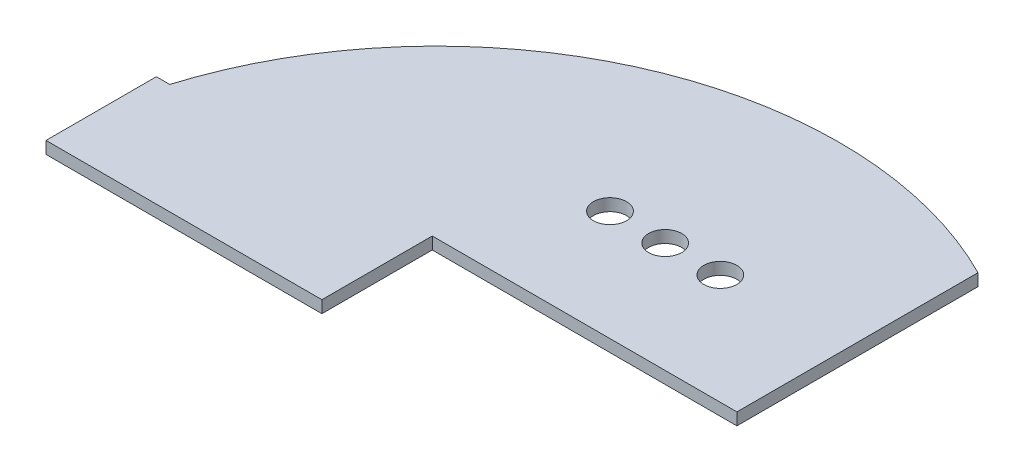
ISO-10303-21;
HEADER;
FILE_DESCRIPTION(('STEP AP214'),'2;1');
FILE_NAME('part.step','',(''),(''),'','','');
FILE_SCHEMA(('AUTOMOTIVE_DESIGN { 1 0 10303 214 1 1 1 1 }'));
ENDSEC;
DATA;
#1=APPLICATION_CONTEXT('core data for automotive mechanical design processes');
#2=APPLICATION_PROTOCOL_DEFINITION('international standard','automotive_design',2000,#1);
#3=PRODUCT_CONTEXT('',#1,'mechanical');
#4=PRODUCT('Part','Part','',(#3));
#5=PRODUCT_RELATED_PRODUCT_CATEGORY('part','',(#4));
#6=PRODUCT_DEFINITION_FORMATION('','',#4);
#7=PRODUCT_DEFINITION_CONTEXT('part definition',#1,'design');
#8=PRODUCT_DEFINITION('design','',#6,#7);
#9=PRODUCT_DEFINITION_SHAPE('','',#8);
#10=(LENGTH_UNIT() NAMED_UNIT(*) SI_UNIT(.MILLI.,.METRE.));
#11=(NAMED_UNIT(*) PLANE_ANGLE_UNIT() SI_UNIT($,.RADIAN.));
#12=(NAMED_UNIT(*) SI_UNIT($,.STERADIAN.) SOLID_ANGLE_UNIT());
#13=UNCERTAINTY_MEASURE_WITH_UNIT(LENGTH_MEASURE(1.E-05),#10,'distance_accuracy_value','');
#14=(GEOMETRIC_REPRESENTATION_CONTEXT(3) GLOBAL_UNCERTAINTY_ASSIGNED_CONTEXT((#13)) GLOBAL_UNIT_ASSIGNED_CONTEXT((#10,
#11,#12)) REPRESENTATION_CONTEXT('',''));
#15=CARTESIAN_POINT('',(0.,0.,0.));
#16=DIRECTION('',(0.,0.,1.));
#17=DIRECTION('',(1.,0.,0.));
#18=AXIS2_PLACEMENT_3D('',#15,#16,#17);
#19=CARTESIAN_POINT('',(0.,1.1,0.));
#20=DIRECTION('',(0.,-1.,0.));
#21=DIRECTION('',(0.,0.,-1.));
#22=AXIS2_PLACEMENT_3D('',#19,#20,#21);
#23=CYLINDRICAL_SURFACE('',#22,73.);
#24=CARTESIAN_POINT('',(0.,-1.1,0.));
#25=DIRECTION('',(0.,1.,0.));
#26=DIRECTION('',(0.,0.,-1.));
#27=AXIS2_PLACEMENT_3D('',#24,#25,#26);
#28=CIRCLE('',#27,73.);
#29=CARTESIAN_POINT('',(32.9996197349395,-1.1,-65.1154750988534));
#30=VERTEX_POINT('',#29);
#31=CARTESIAN_POINT('',(-69.7867007387511,-1.1,-21.42));
#32=VERTEX_POINT('',#31);
#33=EDGE_CURVE('E133',#30,#32,#28,.T.);
#34=ORIENTED_EDGE('',*,*,#33,.T.);
#35=DIRECTION('',(0.,-1.,0.));
#36=VECTOR('',#35,1.);
#37=CARTESIAN_POINT('',(-69.7867007387511,1.1,-21.42));
#38=LINE('',#37,#36);
#39=CARTESIAN_POINT('',(-69.7867007387511,1.1,-21.42));
#40=VERTEX_POINT('',#39);
#41=EDGE_CURVE('E11',#40,#32,#38,.T.);
#42=ORIENTED_EDGE('',*,*,#41,.F.);
#43=CARTESIAN_POINT('',(0.,1.1,0.));
#44=DIRECTION('',(0.,1.,0.));
#45=DIRECTION('',(0.,0.,-1.));
#46=AXIS2_PLACEMENT_3D('',#43,#44,#45);
#47=CIRCLE('',#46,73.);
#48=CARTESIAN_POINT('',(32.9996197349395,1.1,-65.1154750988534));
#49=VERTEX_POINT('',#48);
#50=EDGE_CURVE('E153',#49,#40,#47,.T.);
#51=ORIENTED_EDGE('',*,*,#50,.F.);
#52=DIRECTION('',(0.,-1.,0.));
#53=VECTOR('',#52,1.);
#54=CARTESIAN_POINT('',(32.9996197349395,1.1,-65.1154750988534));
#55=LINE('',#54,#53);
#56=EDGE_CURVE('E129',#49,#30,#55,.T.);
#57=ORIENTED_EDGE('',*,*,#56,.T.);
#58=EDGE_LOOP('',(#34,#42,#51,#57));
#59=FACE_BOUND('',#58,.T.);
#60=ADVANCED_FACE('F38',(#59),#23,.T.);
#61=CARTESIAN_POINT('',(-72.2103802650606,1.1,-21.42));
#62=DIRECTION('',(0.,0.,1.));
#63=DIRECTION('',(1.,0.,0.));
#64=AXIS2_PLACEMENT_3D('',#61,#62,#63);
#65=PLANE('',#64);
#66=DIRECTION('',(-1.,0.,0.));
#67=VECTOR('',#66,1.);
#68=CARTESIAN_POINT('',(-72.2103802650606,-1.1,-21.42));
#69=LINE('',#68,#67);
#70=CARTESIAN_POINT('',(-72.2103802650606,-1.1,-21.42));
#71=VERTEX_POINT('',#70);
#72=EDGE_CURVE('E137',#32,#71,#69,.T.);
#73=ORIENTED_EDGE('',*,*,#72,.T.);
#74=DIRECTION('',(0.,-1.,0.));
#75=VECTOR('',#74,1.);
#76=CARTESIAN_POINT('',(-72.2103802650606,1.1,-21.42));
#77=LINE('',#76,#75);
#78=CARTESIAN_POINT('',(-72.2103802650606,1.1,-21.42));
#79=VERTEX_POINT('',#78);
#80=EDGE_CURVE('E47',#79,#71,#77,.T.);
#81=ORIENTED_EDGE('',*,*,#80,.F.);
#82=DIRECTION('',(-1.,0.,0.));
#83=VECTOR('',#82,1.);
#84=CARTESIAN_POINT('',(-72.2103802650606,1.1,-21.42));
#85=LINE('',#84,#83);
#86=EDGE_CURVE('E95',#40,#79,#85,.T.);
#87=ORIENTED_EDGE('',*,*,#86,.F.);
#88=ORIENTED_EDGE('',*,*,#41,.T.);
#89=EDGE_LOOP('',(#73,#81,#87,#88));
#90=FACE_BOUND('',#89,.T.);
#91=ADVANCED_FACE('F237',(#90),#65,.F.);
#92=CARTESIAN_POINT('',(-72.2103802650606,1.1,-1.41999999999999));
#93=DIRECTION('',(1.,0.,0.));
#94=DIRECTION('',(0.,0.,-1.));
#95=AXIS2_PLACEMENT_3D('',#92,#93,#94);
#96=PLANE('',#95);
#97=DIRECTION('',(0.,0.,1.));
#98=VECTOR('',#97,1.);
#99=CARTESIAN_POINT('',(-72.2103802650606,-1.1,-1.41999999999999));
#100=LINE('',#99,#98);
#101=CARTESIAN_POINT('',(-72.2103802650606,-1.1,-1.41999999999999));
#102=VERTEX_POINT('',#101);
#103=EDGE_CURVE('E141',#71,#102,#100,.T.);
#104=ORIENTED_EDGE('',*,*,#103,.T.);
#105=DIRECTION('',(0.,-1.,0.));
#106=VECTOR('',#105,1.);
#107=CARTESIAN_POINT('',(-72.2103802650606,1.1,-1.41999999999999));
#108=LINE('',#107,#106);
#109=CARTESIAN_POINT('',(-72.2103802650606,1.1,-1.41999999999999));
#110=VERTEX_POINT('',#109);
#111=EDGE_CURVE('E160',#110,#102,#108,.T.);
#112=ORIENTED_EDGE('',*,*,#111,.F.);
#113=DIRECTION('',(0.,0.,1.));
#114=VECTOR('',#113,1.);
#115=CARTESIAN_POINT('',(-72.2103802650606,1.1,-1.41999999999999));
#116=LINE('',#115,#114);
#117=EDGE_CURVE('E170',#79,#110,#116,.T.);
#118=ORIENTED_EDGE('',*,*,#117,.F.);
#119=ORIENTED_EDGE('',*,*,#80,.T.);
#120=EDGE_LOOP('',(#104,#112,#118,#119));
#121=FACE_BOUND('',#120,.T.);
#122=ADVANCED_FACE('F168',(#121),#96,.F.);
#123=CARTESIAN_POINT('',(-72.2103802650606,1.1,-1.41999999999999));
#124=DIRECTION('',(0.,0.,-1.));
#125=DIRECTION('',(-1.,0.,0.));
#126=AXIS2_PLACEMENT_3D('',#123,#124,#125);
#127=PLANE('',#126);
#128=DIRECTION('',(1.,0.,0.));
#129=VECTOR('',#128,1.);
#130=CARTESIAN_POINT('',(-72.2103802650606,-1.1,-1.41999999999999));
#131=LINE('',#130,#129);
#132=CARTESIAN_POINT('',(-22.2103802650605,-1.1,-1.41999999999999));
#133=VERTEX_POINT('',#132);
#134=EDGE_CURVE('E144',#102,#133,#131,.T.);
#135=ORIENTED_EDGE('',*,*,#134,.T.);
#136=DIRECTION('',(0.,-1.,0.));
#137=VECTOR('',#136,1.);
#138=CARTESIAN_POINT('',(-22.2103802650605,1.1,-1.41999999999999));
#139=LINE('',#138,#137);
#140=CARTESIAN_POINT('',(-22.2103802650605,1.1,-1.41999999999999));
#141=VERTEX_POINT('',#140);
#142=EDGE_CURVE('E122',#141,#133,#139,.T.);
#143=ORIENTED_EDGE('',*,*,#142,.F.);
#144=DIRECTION('',(1.,0.,0.));
#145=VECTOR('',#144,1.);
#146=CARTESIAN_POINT('',(-72.2103802650606,1.1,-1.41999999999999));
#147=LINE('',#146,#145);
#148=EDGE_CURVE('E111',#110,#141,#147,.T.);
#149=ORIENTED_EDGE('',*,*,#148,.F.);
#150=ORIENTED_EDGE('',*,*,#111,.T.);
#151=EDGE_LOOP('',(#135,#143,#149,#150));
#152=FACE_BOUND('',#151,.T.);
#153=ADVANCED_FACE('F176',(#152),#127,.F.);
#154=CARTESIAN_POINT('',(-22.2103802650605,1.1,-1.41999999999999));
#155=DIRECTION('',(-1.,0.,0.));
#156=DIRECTION('',(0.,0.,1.));
#157=AXIS2_PLACEMENT_3D('',#154,#155,#156);
#158=PLANE('',#157);
#159=DIRECTION('',(0.,0.,-1.));
#160=VECTOR('',#159,1.);
#161=CARTESIAN_POINT('',(-22.2103802650605,-1.1,-1.41999999999999));
#162=LINE('',#161,#160);
#163=CARTESIAN_POINT('',(-22.2103802650605,-1.1,-21.42));
#164=VERTEX_POINT('',#163);
#165=EDGE_CURVE('E120',#133,#164,#162,.T.);
#166=ORIENTED_EDGE('',*,*,#165,.T.);
#167=DIRECTION('',(0.,-1.,0.));
#168=VECTOR('',#167,1.);
#169=CARTESIAN_POINT('',(-22.2103802650605,1.1,-21.42));
#170=LINE('',#169,#168);
#171=CARTESIAN_POINT('',(-22.2103802650605,1.1,-21.42));
#172=VERTEX_POINT('',#171);
#173=EDGE_CURVE('E117',#172,#164,#170,.T.);
#174=ORIENTED_EDGE('',*,*,#173,.F.);
#175=DIRECTION('',(0.,0.,-1.));
#176=VECTOR('',#175,1.);
#177=CARTESIAN_POINT('',(-22.2103802650605,1.1,-1.41999999999999));
#178=LINE('',#177,#176);
#179=EDGE_CURVE('E105',#141,#172,#178,.T.);
#180=ORIENTED_EDGE('',*,*,#179,.F.);
#181=ORIENTED_EDGE('',*,*,#142,.T.);
#182=EDGE_LOOP('',(#166,#174,#180,#181));
#183=FACE_BOUND('',#182,.T.);
#184=ADVANCED_FACE('F118',(#183),#158,.F.);
#185=CARTESIAN_POINT('',(32.9996197349395,1.1,-21.42));
#186=DIRECTION('',(0.,0.,-1.));
#187=DIRECTION('',(-1.,0.,0.));
#188=AXIS2_PLACEMENT_3D('',#185,#186,#187);
#189=PLANE('',#188);
#190=DIRECTION('',(1.,0.,0.));
#191=VECTOR('',#190,1.);
#192=CARTESIAN_POINT('',(32.9996197349395,-1.1,-21.42));
#193=LINE('',#192,#191);
#194=CARTESIAN_POINT('',(32.9996197349395,-1.1,-21.42));
#195=VERTEX_POINT('',#194);
#196=EDGE_CURVE('E81',#164,#195,#193,.T.);
#197=ORIENTED_EDGE('',*,*,#196,.T.);
#198=DIRECTION('',(0.,-1.,0.));
#199=VECTOR('',#198,1.);
#200=CARTESIAN_POINT('',(32.9996197349395,1.1,-21.42));
#201=LINE('',#200,#199);
#202=CARTESIAN_POINT('',(32.9996197349395,1.1,-21.42));
#203=VERTEX_POINT('',#202);
#204=EDGE_CURVE('E123',#203,#195,#201,.T.);
#205=ORIENTED_EDGE('',*,*,#204,.F.);
#206=DIRECTION('',(1.,0.,0.));
#207=VECTOR('',#206,1.);
#208=CARTESIAN_POINT('',(32.9996197349395,1.1,-21.42));
#209=LINE('',#208,#207);
#210=EDGE_CURVE('E109',#172,#203,#209,.T.);
#211=ORIENTED_EDGE('',*,*,#210,.F.);
#212=ORIENTED_EDGE('',*,*,#173,.T.);
#213=EDGE_LOOP('',(#197,#205,#211,#212));
#214=FACE_BOUND('',#213,.T.);
#215=ADVANCED_FACE('F125',(#214),#189,.F.);
#216=CARTESIAN_POINT('',(32.9996197349395,1.1,-65.1154750988534));
#217=DIRECTION('',(-1.,0.,0.));
#218=DIRECTION('',(0.,0.,1.));
#219=AXIS2_PLACEMENT_3D('',#216,#217,#218);
#220=PLANE('',#219);
#221=DIRECTION('',(0.,0.,-1.));
#222=VECTOR('',#221,1.);
#223=CARTESIAN_POINT('',(32.9996197349395,-1.1,-65.1154750988534));
#224=LINE('',#223,#222);
#225=EDGE_CURVE('E87',#195,#30,#224,.T.);
#226=ORIENTED_EDGE('',*,*,#225,.T.);
#227=ORIENTED_EDGE('',*,*,#56,.F.);
#228=DIRECTION('',(0.,0.,-1.));
#229=VECTOR('',#228,1.);
#230=CARTESIAN_POINT('',(32.9996197349395,1.1,-65.1154750988534));
#231=LINE('',#230,#229);
#232=EDGE_CURVE('E55',#203,#49,#231,.T.);
#233=ORIENTED_EDGE('',*,*,#232,.F.);
#234=ORIENTED_EDGE('',*,*,#204,.T.);
#235=EDGE_LOOP('',(#226,#227,#233,#234));
#236=FACE_BOUND('',#235,.T.);
#237=ADVANCED_FACE('F221',(#236),#220,.F.);
#238=CARTESIAN_POINT('',(0.,1.1,0.));
#239=DIRECTION('',(0.,-1.,0.));
#240=DIRECTION('',(0.,0.,-1.));
#241=AXIS2_PLACEMENT_3D('',#238,#239,#240);
#242=PLANE('',#241);
#243=CARTESIAN_POINT('',(-10.,1.1,-41.42));
#244=DIRECTION('',(0.,1.,0.));
#245=DIRECTION('',(0.,0.,1.));
#246=AXIS2_PLACEMENT_3D('',#243,#244,#245);
#247=CIRCLE('',#246,3.);
#248=CARTESIAN_POINT('',(-10.,1.1,-38.42));
#249=VERTEX_POINT('',#248);
#250=EDGE_CURVE('E193',#249,#249,#247,.T.);
#251=ORIENTED_EDGE('',*,*,#250,.F.);
#252=EDGE_LOOP('',(#251));
#253=FACE_BOUND('',#252,.T.);
#254=CARTESIAN_POINT('',(10.,1.1,-41.42));
#255=DIRECTION('',(0.,1.,0.));
#256=DIRECTION('',(0.,0.,1.));
#257=AXIS2_PLACEMENT_3D('',#254,#255,#256);
#258=CIRCLE('',#257,3.);
#259=CARTESIAN_POINT('',(10.,1.1,-38.42));
#260=VERTEX_POINT('',#259);
#261=EDGE_CURVE('E201',#260,#260,#258,.T.);
#262=ORIENTED_EDGE('',*,*,#261,.F.);
#263=EDGE_LOOP('',(#262));
#264=FACE_BOUND('',#263,.T.);
#265=CARTESIAN_POINT('',(0.,1.1,-41.42));
#266=DIRECTION('',(0.,1.,0.));
#267=DIRECTION('',(0.,0.,1.));
#268=AXIS2_PLACEMENT_3D('',#265,#266,#267);
#269=CIRCLE('',#268,3.);
#270=CARTESIAN_POINT('',(0.,1.1,-38.42));
#271=VERTEX_POINT('',#270);
#272=EDGE_CURVE('E185',#271,#271,#269,.T.);
#273=ORIENTED_EDGE('',*,*,#272,.F.);
#274=EDGE_LOOP('',(#273));
#275=FACE_BOUND('',#274,.T.);
#276=ORIENTED_EDGE('',*,*,#50,.T.);
#277=ORIENTED_EDGE('',*,*,#86,.T.);
#278=ORIENTED_EDGE('',*,*,#117,.T.);
#279=ORIENTED_EDGE('',*,*,#148,.T.);
#280=ORIENTED_EDGE('',*,*,#179,.T.);
#281=ORIENTED_EDGE('',*,*,#210,.T.);
#282=ORIENTED_EDGE('',*,*,#232,.T.);
#283=EDGE_LOOP('',(#276,#277,#278,#279,#280,#281,#282));
#284=FACE_BOUND('',#283,.T.);
#285=ADVANCED_FACE('F107',(#253,#264,#275,#284),#242,.F.);
#286=CARTESIAN_POINT('',(0.,-1.1,0.));
#287=DIRECTION('',(0.,-1.,0.));
#288=DIRECTION('',(0.,0.,-1.));
#289=AXIS2_PLACEMENT_3D('',#286,#287,#288);
#290=PLANE('',#289);
#291=CARTESIAN_POINT('',(-10.,-1.1,-41.42));
#292=DIRECTION('',(0.,1.,0.));
#293=DIRECTION('',(0.,0.,1.));
#294=AXIS2_PLACEMENT_3D('',#291,#292,#293);
#295=CIRCLE('',#294,3.);
#296=CARTESIAN_POINT('',(-10.,-1.1,-38.42));
#297=VERTEX_POINT('',#296);
#298=EDGE_CURVE('E197',#297,#297,#295,.T.);
#299=ORIENTED_EDGE('',*,*,#298,.T.);
#300=EDGE_LOOP('',(#299));
#301=FACE_BOUND('',#300,.T.);
#302=CARTESIAN_POINT('',(10.,-1.1,-41.42));
#303=DIRECTION('',(0.,1.,0.));
#304=DIRECTION('',(0.,0.,1.));
#305=AXIS2_PLACEMENT_3D('',#302,#303,#304);
#306=CIRCLE('',#305,3.);
#307=CARTESIAN_POINT('',(10.,-1.1,-38.42));
#308=VERTEX_POINT('',#307);
#309=EDGE_CURVE('E189',#308,#308,#306,.T.);
#310=ORIENTED_EDGE('',*,*,#309,.T.);
#311=EDGE_LOOP('',(#310));
#312=FACE_BOUND('',#311,.T.);
#313=CARTESIAN_POINT('',(0.,-1.1,-41.42));
#314=DIRECTION('',(0.,1.,0.));
#315=DIRECTION('',(0.,0.,1.));
#316=AXIS2_PLACEMENT_3D('',#313,#314,#315);
#317=CIRCLE('',#316,3.);
#318=CARTESIAN_POINT('',(0.,-1.1,-38.42));
#319=VERTEX_POINT('',#318);
#320=EDGE_CURVE('E138',#319,#319,#317,.T.);
#321=ORIENTED_EDGE('',*,*,#320,.T.);
#322=EDGE_LOOP('',(#321));
#323=FACE_BOUND('',#322,.T.);
#324=ORIENTED_EDGE('',*,*,#33,.F.);
#325=ORIENTED_EDGE('',*,*,#225,.F.);
#326=ORIENTED_EDGE('',*,*,#196,.F.);
#327=ORIENTED_EDGE('',*,*,#165,.F.);
#328=ORIENTED_EDGE('',*,*,#134,.F.);
#329=ORIENTED_EDGE('',*,*,#103,.F.);
#330=ORIENTED_EDGE('',*,*,#72,.F.);
#331=EDGE_LOOP('',(#324,#325,#326,#327,#328,#329,#330));
#332=FACE_BOUND('',#331,.T.);
#333=ADVANCED_FACE('F174',(#301,#312,#323,#332),#290,.T.);
#334=CARTESIAN_POINT('',(0.,-1.1,-41.42));
#335=DIRECTION('',(0.,1.,0.));
#336=DIRECTION('',(0.,0.,1.));
#337=AXIS2_PLACEMENT_3D('',#334,#335,#336);
#338=CYLINDRICAL_SURFACE('',#337,3.);
#339=ORIENTED_EDGE('',*,*,#320,.F.);
#340=EDGE_LOOP('',(#339));
#341=FACE_BOUND('',#340,.T.);
#342=ORIENTED_EDGE('',*,*,#272,.T.);
#343=EDGE_LOOP('',(#342));
#344=FACE_BOUND('',#343,.T.);
#345=ADVANCED_FACE('F215',(#341,#344),#338,.F.);
#346=CARTESIAN_POINT('',(10.,-1.1,-41.42));
#347=DIRECTION('',(0.,1.,0.));
#348=DIRECTION('',(0.,0.,1.));
#349=AXIS2_PLACEMENT_3D('',#346,#347,#348);
#350=CYLINDRICAL_SURFACE('',#349,3.);
#351=ORIENTED_EDGE('',*,*,#309,.F.);
#352=EDGE_LOOP('',(#351));
#353=FACE_BOUND('',#352,.T.);
#354=ORIENTED_EDGE('',*,*,#261,.T.);
#355=EDGE_LOOP('',(#354));
#356=FACE_BOUND('',#355,.T.);
#357=ADVANCED_FACE('F211',(#353,#356),#350,.F.);
#358=CARTESIAN_POINT('',(-10.,-1.1,-41.42));
#359=DIRECTION('',(0.,1.,0.));
#360=DIRECTION('',(0.,0.,1.));
#361=AXIS2_PLACEMENT_3D('',#358,#359,#360);
#362=CYLINDRICAL_SURFACE('',#361,3.);
#363=ORIENTED_EDGE('',*,*,#298,.F.);
#364=EDGE_LOOP('',(#363));
#365=FACE_BOUND('',#364,.T.);
#366=ORIENTED_EDGE('',*,*,#250,.T.);
#367=EDGE_LOOP('',(#366));
#368=FACE_BOUND('',#367,.T.);
#369=ADVANCED_FACE('F214',(#365,#368),#362,.F.);
#370=CLOSED_SHELL('',(#60,#91,#122,#153,#184,#215,#237,#285,#333,#345,#357,#369));
#371=MANIFOLD_SOLID_BREP('B2',#370);
#372=ADVANCED_BREP_SHAPE_REPRESENTATION('',(#18,#371),#14);
#373=SHAPE_DEFINITION_REPRESENTATION(#9,#372);
ENDSEC;
END-ISO-10303-21;
